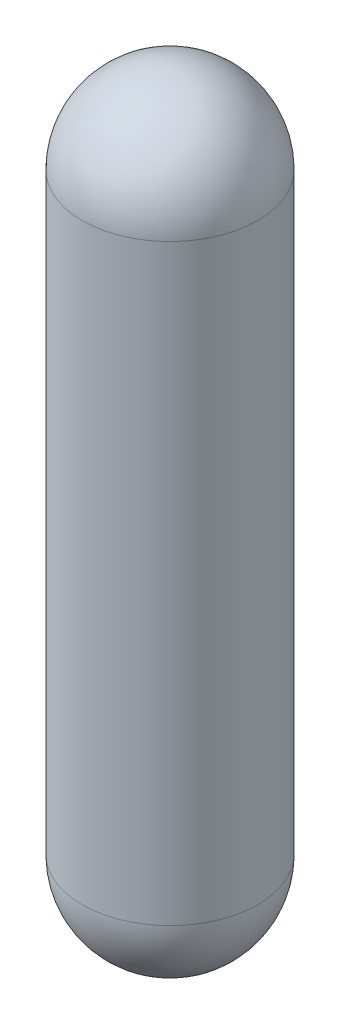
ISO-10303-21;
HEADER;
FILE_DESCRIPTION(('STEP AP214'),'2;1');
FILE_NAME('part.step','',(''),(''),'','','');
FILE_SCHEMA(('AUTOMOTIVE_DESIGN { 1 0 10303 214 1 1 1 1 }'));
ENDSEC;
DATA;
#1=APPLICATION_CONTEXT('core data for automotive mechanical design processes');
#2=APPLICATION_PROTOCOL_DEFINITION('international standard','automotive_design',2000,#1);
#3=PRODUCT_CONTEXT('',#1,'mechanical');
#4=PRODUCT('Part','Part','',(#3));
#5=PRODUCT_RELATED_PRODUCT_CATEGORY('part','',(#4));
#6=PRODUCT_DEFINITION_FORMATION('','',#4);
#7=PRODUCT_DEFINITION_CONTEXT('part definition',#1,'design');
#8=PRODUCT_DEFINITION('design','',#6,#7);
#9=PRODUCT_DEFINITION_SHAPE('','',#8);
#10=(LENGTH_UNIT() NAMED_UNIT(*) SI_UNIT(.MILLI.,.METRE.));
#11=(NAMED_UNIT(*) PLANE_ANGLE_UNIT() SI_UNIT($,.RADIAN.));
#12=(NAMED_UNIT(*) SI_UNIT($,.STERADIAN.) SOLID_ANGLE_UNIT());
#13=UNCERTAINTY_MEASURE_WITH_UNIT(LENGTH_MEASURE(1.E-05),#10,'distance_accuracy_value','');
#14=(GEOMETRIC_REPRESENTATION_CONTEXT(3) GLOBAL_UNCERTAINTY_ASSIGNED_CONTEXT((#13)) GLOBAL_UNIT_ASSIGNED_CONTEXT((#10,
#11,#12)) REPRESENTATION_CONTEXT('',''));
#15=CARTESIAN_POINT('',(0.,0.,0.));
#16=DIRECTION('',(0.,0.,1.));
#17=DIRECTION('',(1.,0.,0.));
#18=AXIS2_PLACEMENT_3D('',#15,#16,#17);
#19=CARTESIAN_POINT('',(-1.11022302462516E-13,1542.8,0.));
#20=DIRECTION('',(0.,-1.,0.));
#21=DIRECTION('',(1.,0.,0.));
#22=AXIS2_PLACEMENT_3D('',#19,#20,#21);
#23=SPHERICAL_SURFACE('',#22,228.6);
#24=CARTESIAN_POINT('',(0.,1542.8,0.));
#25=DIRECTION('',(0.,-1.,0.));
#26=DIRECTION('',(0.,0.,-1.));
#27=AXIS2_PLACEMENT_3D('',#24,#25,#26);
#28=CIRCLE('',#27,228.6);
#29=CARTESIAN_POINT('',(0.,1542.8,-228.6));
#30=VERTEX_POINT('',#29);
#31=EDGE_CURVE('E84',#30,#30,#28,.T.);
#32=ORIENTED_EDGE('',*,*,#31,.F.);
#33=EDGE_LOOP('',(#32));
#34=FACE_BOUND('',#33,.T.);
#35=ADVANCED_FACE('F40',(#34),#23,.T.);
#36=CARTESIAN_POINT('',(1.52655665885959E-13,2.35922392732846E-13,0.));
#37=DIRECTION('',(0.,-1.,0.));
#38=DIRECTION('',(-1.,0.,0.));
#39=AXIS2_PLACEMENT_3D('',#36,#37,#38);
#40=SPHERICAL_SURFACE('',#39,228.6);
#41=CARTESIAN_POINT('',(0.,0.,0.));
#42=DIRECTION('',(0.,-1.,0.));
#43=DIRECTION('',(0.,0.,-1.));
#44=AXIS2_PLACEMENT_3D('',#41,#42,#43);
#45=CIRCLE('',#44,228.6);
#46=CARTESIAN_POINT('',(0.,0.,-228.6));
#47=VERTEX_POINT('',#46);
#48=EDGE_CURVE('E85',#47,#47,#45,.T.);
#49=ORIENTED_EDGE('',*,*,#48,.T.);
#50=EDGE_LOOP('',(#49));
#51=FACE_BOUND('',#50,.T.);
#52=ADVANCED_FACE('F69',(#51),#40,.T.);
#53=CARTESIAN_POINT('',(0.,0.,0.));
#54=DIRECTION('',(0.,-1.,0.));
#55=DIRECTION('',(0.,0.,-1.));
#56=AXIS2_PLACEMENT_3D('',#53,#54,#55);
#57=CYLINDRICAL_SURFACE('',#56,228.6);
#58=ORIENTED_EDGE('',*,*,#31,.T.);
#59=EDGE_LOOP('',(#58));
#60=FACE_BOUND('',#59,.T.);
#61=ORIENTED_EDGE('',*,*,#48,.F.);
#62=EDGE_LOOP('',(#61));
#63=FACE_BOUND('',#62,.T.);
#64=ADVANCED_FACE('F72',(#60,#63),#57,.T.);
#65=CLOSED_SHELL('',(#35,#52,#64));
#66=CARTESIAN_POINT('',(0.,1543.05794379958,10.7960648230414));
#67=DIRECTION('',(-1.,0.,0.));
#68=DIRECTION('',(0.,0.,-1.));
#69=AXIS2_PLACEMENT_3D('',#66,#67,#68);
#70=CIRCLE('',#69,226.06);
#71=TRIMMED_CURVE('',#70,(PARAMETER_VALUE(-1.52302063472147)),
(PARAMETER_VALUE(1.52302063472147)),.T.,.PARAMETER.);
#72=CARTESIAN_POINT('',(0.,1543.05794379958,0.));
#73=DIRECTION('',(0.,-1.,0.));
#74=AXIS1_PLACEMENT('',#72,#73);
#75=SURFACE_OF_REVOLUTION('',#71,#74);
#76=CARTESIAN_POINT('',(0.,1542.8,0.));
#77=DIRECTION('',(0.,-1.,0.));
#78=DIRECTION('',(0.,0.,-1.));
#79=AXIS2_PLACEMENT_3D('',#76,#77,#78);
#80=CIRCLE('',#79,215.263788014645);
#81=CARTESIAN_POINT('',(0.,1542.8,-215.263788014645));
#82=VERTEX_POINT('',#81);
#83=EDGE_CURVE('E11',#82,#82,#80,.T.);
#84=ORIENTED_EDGE('',*,*,#83,.T.);
#85=EDGE_LOOP('',(#84));
#86=FACE_BOUND('',#85,.T.);
#87=CARTESIAN_POINT('',(0.,1768.86,0.));
#88=VERTEX_POINT('',#87);
#89=VERTEX_LOOP('',#88);
#90=FACE_BOUND('',#89,.T.);
#91=ADVANCED_FACE('F54',(#86,#90),#75,.F.);
#92=CARTESIAN_POINT('',(0.,0.,0.));
#93=DIRECTION('',(0.,-1.,0.));
#94=DIRECTION('',(0.,0.,-1.));
#95=AXIS2_PLACEMENT_3D('',#92,#93,#94);
#96=CYLINDRICAL_SURFACE('',#95,215.263788014645);
#97=CARTESIAN_POINT('',(0.,0.,0.));
#98=DIRECTION('',(0.,-1.,0.));
#99=DIRECTION('',(0.,0.,-1.));
#100=AXIS2_PLACEMENT_3D('',#97,#98,#99);
#101=CIRCLE('',#100,215.263788014645);
#102=CARTESIAN_POINT('',(0.,0.,-215.263788014645));
#103=VERTEX_POINT('',#102);
#104=EDGE_CURVE('E48',#103,#103,#101,.T.);
#105=ORIENTED_EDGE('',*,*,#104,.T.);
#106=EDGE_LOOP('',(#105));
#107=FACE_BOUND('',#106,.T.);
#108=ORIENTED_EDGE('',*,*,#83,.F.);
#109=EDGE_LOOP('',(#108));
#110=FACE_BOUND('',#109,.T.);
#111=ADVANCED_FACE('F56',(#107,#110),#96,.F.);
#112=CARTESIAN_POINT('',(0.,-0.257943799581786,10.7960648230413));
#113=DIRECTION('',(-1.,0.,0.));
#114=DIRECTION('',(0.,0.,-1.));
#115=AXIS2_PLACEMENT_3D('',#112,#113,#114);
#116=CIRCLE('',#115,226.06);
#117=TRIMMED_CURVE('',#116,(PARAMETER_VALUE(-1.52302063472147)),
(PARAMETER_VALUE(1.52302063472147)),.T.,.PARAMETER.);
#118=CARTESIAN_POINT('',(0.,-0.257943799581786,0.));
#119=DIRECTION('',(0.,-1.,0.));
#120=AXIS1_PLACEMENT('',#118,#119);
#121=SURFACE_OF_REVOLUTION('',#117,#120);
#122=CARTESIAN_POINT('',(0.,-226.06,0.));
#123=VERTEX_POINT('',#122);
#124=VERTEX_LOOP('',#123);
#125=FACE_BOUND('',#124,.T.);
#126=ORIENTED_EDGE('',*,*,#104,.F.);
#127=EDGE_LOOP('',(#126));
#128=FACE_BOUND('',#127,.T.);
#129=ADVANCED_FACE('F63',(#125,#128),#121,.F.);
#130=CLOSED_SHELL('',(#91,#111,#129));
#131=ORIENTED_CLOSED_SHELL('',*,#65,.T.);
#132=BREP_WITH_VOIDS('B2',#130,(#131));
#133=ADVANCED_BREP_SHAPE_REPRESENTATION('',(#18,#132),#14);
#134=SHAPE_DEFINITION_REPRESENTATION(#9,#133);
ENDSEC;
END-ISO-10303-21;
